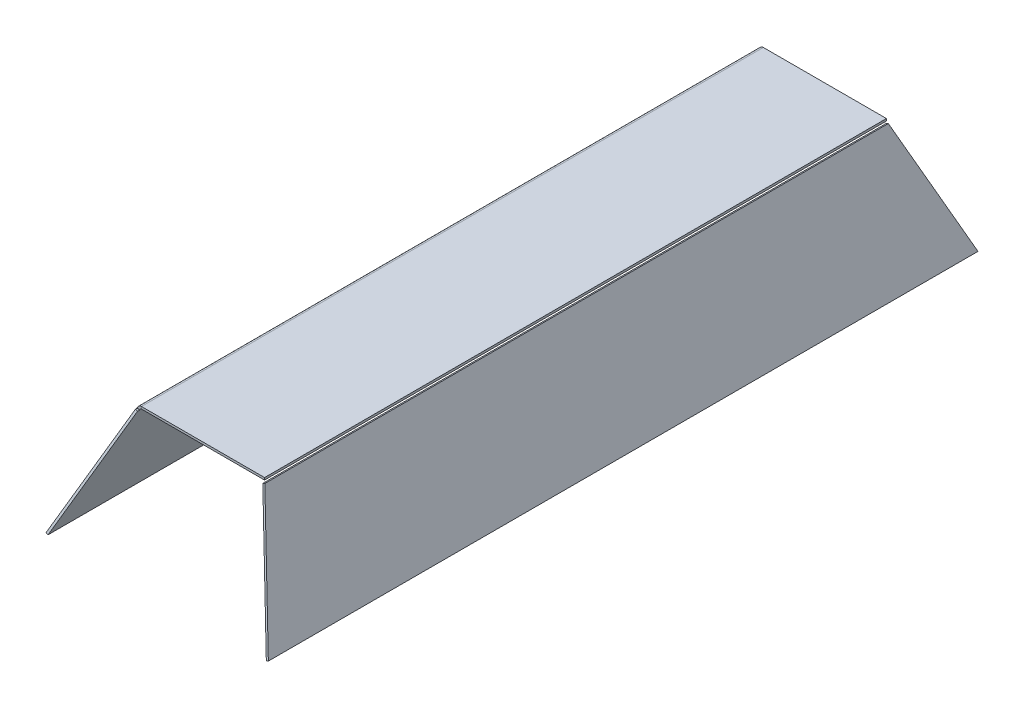
ISO-10303-21;
HEADER;
FILE_DESCRIPTION(('STEP AP214'),'2;1');
FILE_NAME('part.step','',(''),(''),'','','');
FILE_SCHEMA(('AUTOMOTIVE_DESIGN { 1 0 10303 214 1 1 1 1 }'));
ENDSEC;
DATA;
#1=APPLICATION_CONTEXT('core data for automotive mechanical design processes');
#2=APPLICATION_PROTOCOL_DEFINITION('international standard','automotive_design',2000,#1);
#3=PRODUCT_CONTEXT('',#1,'mechanical');
#4=PRODUCT('Part','Part','',(#3));
#5=PRODUCT_RELATED_PRODUCT_CATEGORY('part','',(#4));
#6=PRODUCT_DEFINITION_FORMATION('','',#4);
#7=PRODUCT_DEFINITION_CONTEXT('part definition',#1,'design');
#8=PRODUCT_DEFINITION('design','',#6,#7);
#9=PRODUCT_DEFINITION_SHAPE('','',#8);
#10=(LENGTH_UNIT() NAMED_UNIT(*) SI_UNIT(.MILLI.,.METRE.));
#11=(NAMED_UNIT(*) PLANE_ANGLE_UNIT() SI_UNIT($,.RADIAN.));
#12=(NAMED_UNIT(*) SI_UNIT($,.STERADIAN.) SOLID_ANGLE_UNIT());
#13=UNCERTAINTY_MEASURE_WITH_UNIT(LENGTH_MEASURE(1.E-05),#10,'distance_accuracy_value','');
#14=(GEOMETRIC_REPRESENTATION_CONTEXT(3) GLOBAL_UNCERTAINTY_ASSIGNED_CONTEXT((#13)) GLOBAL_UNIT_ASSIGNED_CONTEXT((#10,
#11,#12)) REPRESENTATION_CONTEXT('',''));
#15=CARTESIAN_POINT('',(0.,0.,0.));
#16=DIRECTION('',(0.,0.,1.));
#17=DIRECTION('',(1.,0.,0.));
#18=AXIS2_PLACEMENT_3D('',#15,#16,#17);
#19=CARTESIAN_POINT('',(84.8429149943111,-2.76186835749196,427.251193685188));
#20=DIRECTION('',(-0.134369652517472,0.314218264348551,0.939793423488437));
#21=DIRECTION('',(0.,-0.948394146945163,0.317093900982273));
#22=AXIS2_PLACEMENT_3D('',#19,#20,#21);
#23=PLANE('',#22);
#24=DIRECTION('',(0.369516544423051,-0.86410022695852,0.341743063086703));
#25=VECTOR('',#24,1.);
#26=CARTESIAN_POINT('',(87.6012878623114,-1.58230101262345,427.251193685188));
#27=LINE('',#26,#25);
#28=CARTESIAN_POINT('',(87.6012878623114,-1.58230101262345,427.251193685188));
#29=VERTEX_POINT('',#28);
#30=CARTESIAN_POINT('',(151.297924485211,-150.534435884636,486.160284594278));
#31=VERTEX_POINT('',#30);
#32=EDGE_CURVE('E122',#29,#31,#27,.T.);
#33=ORIENTED_EDGE('',*,*,#32,.F.);
#34=DIRECTION('',(0.919457622666744,0.393189114956173,0.));
#35=VECTOR('',#34,1.);
#36=CARTESIAN_POINT('',(84.8429149943111,-2.76186835749196,427.251193685188));
#37=LINE('',#36,#35);
#38=CARTESIAN_POINT('',(84.8429149943111,-2.76186835749196,427.251193685188));
#39=VERTEX_POINT('',#38);
#40=EDGE_CURVE('E12',#39,#29,#37,.T.);
#41=ORIENTED_EDGE('',*,*,#40,.F.);
#42=DIRECTION('',(0.369516544423051,-0.86410022695852,0.341743063086703));
#43=VECTOR('',#42,1.);
#44=CARTESIAN_POINT('',(84.8429149943111,-2.76186835749196,427.251193685188));
#45=LINE('',#44,#43);
#46=CARTESIAN_POINT('',(148.539551617211,-151.714003229505,486.160284594278));
#47=VERTEX_POINT('',#46);
#48=EDGE_CURVE('E116',#39,#47,#45,.T.);
#49=ORIENTED_EDGE('',*,*,#48,.T.);
#50=DIRECTION('',(0.919457622666744,0.393189114956173,0.));
#51=VECTOR('',#50,1.);
#52=CARTESIAN_POINT('',(148.539551617211,-151.714003229505,486.160284594278));
#53=LINE('',#52,#51);
#54=EDGE_CURVE('E61',#47,#31,#53,.T.);
#55=ORIENTED_EDGE('',*,*,#54,.T.);
#56=EDGE_LOOP('',(#33,#41,#49,#55));
#57=FACE_BOUND('',#56,.T.);
#58=ADVANCED_FACE('F58',(#57),#23,.T.);
#59=CARTESIAN_POINT('',(84.8429149943111,-2.76186835749195,-424.930624496631));
#60=DIRECTION('',(-0.393189114956173,0.919457622666744,0.));
#61=DIRECTION('',(-0.919457622666744,-0.393189114956173,0.));
#62=AXIS2_PLACEMENT_3D('',#59,#60,#61);
#63=PLANE('',#62);
#64=DIRECTION('',(0.,0.,1.));
#65=VECTOR('',#64,1.);
#66=CARTESIAN_POINT('',(87.6012878623113,-1.58230101262343,-424.930624496631));
#67=LINE('',#66,#65);
#68=CARTESIAN_POINT('',(87.6012878623113,-1.58230101262343,-424.930624496631));
#69=VERTEX_POINT('',#68);
#70=EDGE_CURVE('E118',#69,#29,#67,.T.);
#71=ORIENTED_EDGE('',*,*,#70,.F.);
#72=DIRECTION('',(0.919457622666744,0.393189114956173,0.));
#73=VECTOR('',#72,1.);
#74=CARTESIAN_POINT('',(84.8429149943111,-2.76186835749195,-424.930624496631));
#75=LINE('',#74,#73);
#76=CARTESIAN_POINT('',(84.8429149943111,-2.76186835749195,-424.930624496631));
#77=VERTEX_POINT('',#76);
#78=EDGE_CURVE('E67',#77,#69,#75,.T.);
#79=ORIENTED_EDGE('',*,*,#78,.F.);
#80=DIRECTION('',(0.,0.,1.));
#81=VECTOR('',#80,1.);
#82=CARTESIAN_POINT('',(84.8429149943111,-2.76186835749195,-424.930624496631));
#83=LINE('',#82,#81);
#84=EDGE_CURVE('E113',#77,#39,#83,.T.);
#85=ORIENTED_EDGE('',*,*,#84,.T.);
#86=ORIENTED_EDGE('',*,*,#40,.T.);
#87=EDGE_LOOP('',(#71,#79,#85,#86));
#88=FACE_BOUND('',#87,.T.);
#89=ADVANCED_FACE('F132',(#88),#63,.T.);
#90=CARTESIAN_POINT('',(148.539551617211,-151.714003229505,-483.839715405722));
#91=DIRECTION('',(-0.134369652517473,0.314218264348552,-0.939793423488437));
#92=DIRECTION('',(0.,0.948394146945163,0.317093900982274));
#93=AXIS2_PLACEMENT_3D('',#90,#91,#92);
#94=PLANE('',#93);
#95=DIRECTION('',(-0.369516544423051,0.864100226958519,0.341743063086704));
#96=VECTOR('',#95,1.);
#97=CARTESIAN_POINT('',(151.297924485211,-150.534435884636,-483.839715405722));
#98=LINE('',#97,#96);
#99=CARTESIAN_POINT('',(151.297924485211,-150.534435884636,-483.839715405722));
#100=VERTEX_POINT('',#99);
#101=EDGE_CURVE('E108',#100,#69,#98,.T.);
#102=ORIENTED_EDGE('',*,*,#101,.F.);
#103=DIRECTION('',(0.919457622666744,0.393189114956173,0.));
#104=VECTOR('',#103,1.);
#105=CARTESIAN_POINT('',(148.539551617211,-151.714003229505,-483.839715405722));
#106=LINE('',#105,#104);
#107=CARTESIAN_POINT('',(148.539551617211,-151.714003229505,-483.839715405722));
#108=VERTEX_POINT('',#107);
#109=EDGE_CURVE('E103',#108,#100,#106,.T.);
#110=ORIENTED_EDGE('',*,*,#109,.F.);
#111=DIRECTION('',(-0.369516544423051,0.864100226958519,0.341743063086704));
#112=VECTOR('',#111,1.);
#113=CARTESIAN_POINT('',(148.539551617211,-151.714003229505,-483.839715405722));
#114=LINE('',#113,#112);
#115=EDGE_CURVE('E106',#108,#77,#114,.T.);
#116=ORIENTED_EDGE('',*,*,#115,.T.);
#117=ORIENTED_EDGE('',*,*,#78,.T.);
#118=EDGE_LOOP('',(#102,#110,#116,#117));
#119=FACE_BOUND('',#118,.T.);
#120=ADVANCED_FACE('F105',(#119),#94,.T.);
#121=CARTESIAN_POINT('',(148.539551617211,-151.714003229505,486.160284594278));
#122=DIRECTION('',(0.393189114956173,-0.919457622666744,0.));
#123=DIRECTION('',(0.919457622666744,0.393189114956173,0.));
#124=AXIS2_PLACEMENT_3D('',#121,#122,#123);
#125=PLANE('',#124);
#126=DIRECTION('',(0.,0.,-1.));
#127=VECTOR('',#126,1.);
#128=CARTESIAN_POINT('',(151.297924485211,-150.534435884636,486.160284594278));
#129=LINE('',#128,#127);
#130=EDGE_CURVE('E125',#31,#100,#129,.T.);
#131=ORIENTED_EDGE('',*,*,#130,.F.);
#132=ORIENTED_EDGE('',*,*,#54,.F.);
#133=DIRECTION('',(0.,0.,-1.));
#134=VECTOR('',#133,1.);
#135=CARTESIAN_POINT('',(148.539551617211,-151.714003229505,486.160284594278));
#136=LINE('',#135,#134);
#137=EDGE_CURVE('E112',#47,#108,#136,.T.);
#138=ORIENTED_EDGE('',*,*,#137,.T.);
#139=ORIENTED_EDGE('',*,*,#109,.T.);
#140=EDGE_LOOP('',(#131,#132,#138,#139));
#141=FACE_BOUND('',#140,.T.);
#142=ADVANCED_FACE('F115',(#141),#125,.T.);
#143=CARTESIAN_POINT('',(70.7279244998553,30.2454940295433,0.));
#144=DIRECTION('',(0.919457622666744,0.393189114956173,0.));
#145=DIRECTION('',(-0.393189114956173,0.919457622666745,0.));
#146=AXIS2_PLACEMENT_3D('',#143,#144,#145);
#147=PLANE('',#146);
#148=ORIENTED_EDGE('',*,*,#48,.F.);
#149=ORIENTED_EDGE('',*,*,#84,.F.);
#150=ORIENTED_EDGE('',*,*,#115,.F.);
#151=ORIENTED_EDGE('',*,*,#137,.F.);
#152=EDGE_LOOP('',(#148,#149,#150,#151));
#153=FACE_BOUND('',#152,.T.);
#154=ADVANCED_FACE('F111',(#153),#147,.F.);
#155=CARTESIAN_POINT('',(73.4862973678555,31.4250613744118,0.));
#156=DIRECTION('',(0.919457622666744,0.393189114956173,0.));
#157=DIRECTION('',(-0.393189114956173,0.919457622666745,0.));
#158=AXIS2_PLACEMENT_3D('',#155,#156,#157);
#159=PLANE('',#158);
#160=ORIENTED_EDGE('',*,*,#32,.T.);
#161=ORIENTED_EDGE('',*,*,#130,.T.);
#162=ORIENTED_EDGE('',*,*,#101,.T.);
#163=ORIENTED_EDGE('',*,*,#70,.T.);
#164=EDGE_LOOP('',(#160,#161,#162,#163));
#165=FACE_BOUND('',#164,.T.);
#166=ADVANCED_FACE('F131',(#165),#159,.T.);
#167=CLOSED_SHELL('',(#58,#89,#120,#142,#154,#166));
#168=MANIFOLD_SOLID_BREP('B2',#167);
#169=CARTESIAN_POINT('',(-74.4010070551372,31.8162201222626,0.));
#170=DIRECTION('',(0.919457622666744,-0.393189114956173,0.));
#171=DIRECTION('',(0.393189114956173,0.919457622666744,0.));
#172=AXIS2_PLACEMENT_3D('',#169,#170,#171);
#173=PLANE('',#172);
#174=DIRECTION('',(0.,0.,1.));
#175=VECTOR('',#174,1.);
#176=CARTESIAN_POINT('',(-152.379906005456,-150.534435884636,-483.839715405722));
#177=LINE('',#176,#175);
#178=CARTESIAN_POINT('',(-152.379906005456,-150.534435884636,-483.839715405722));
#179=VERTEX_POINT('',#178);
#180=CARTESIAN_POINT('',(-152.379906005456,-150.534435884636,486.160284594278));
#181=VERTEX_POINT('',#180);
#182=EDGE_CURVE('E200',#179,#181,#177,.T.);
#183=ORIENTED_EDGE('',*,*,#182,.T.);
#184=DIRECTION('',(0.369516544423051,0.86410022695852,-0.341743063086704));
#185=VECTOR('',#184,1.);
#186=CARTESIAN_POINT('',(-88.2900802675994,-0.662843389956598,426.887557321551));
#187=LINE('',#186,#185);
#188=CARTESIAN_POINT('',(-88.2900802675994,-0.662843389956598,426.887557321551));
#189=VERTEX_POINT('',#188);
#190=EDGE_CURVE('E211',#181,#189,#187,.T.);
#191=ORIENTED_EDGE('',*,*,#190,.T.);
#192=DIRECTION('',(0.,0.,-1.));
#193=VECTOR('',#192,1.);
#194=CARTESIAN_POINT('',(-88.2900802675993,-0.662843389956709,-424.566988132994));
#195=LINE('',#194,#193);
#196=CARTESIAN_POINT('',(-88.2900802675993,-0.662843389956709,-424.566988132994));
#197=VERTEX_POINT('',#196);
#198=EDGE_CURVE('E196',#189,#197,#195,.T.);
#199=ORIENTED_EDGE('',*,*,#198,.T.);
#200=DIRECTION('',(-0.369516544423051,-0.86410022695852,-0.341743063086704));
#201=VECTOR('',#200,1.);
#202=CARTESIAN_POINT('',(-88.2900802675993,-0.662843389956709,-424.566988132994));
#203=LINE('',#202,#201);
#204=EDGE_CURVE('E56',#197,#179,#203,.T.);
#205=ORIENTED_EDGE('',*,*,#204,.T.);
#206=EDGE_LOOP('',(#183,#191,#199,#205));
#207=FACE_BOUND('',#206,.T.);
#208=ADVANCED_FACE('F191',(#207),#173,.F.);
#209=OPEN_SHELL('',(#208));
#210=SHELL_BASED_SURFACE_MODEL('B6',(#209));
#211=CARTESIAN_POINT('',(-152.596469008117,-150.441826705866,-425.));
#212=DIRECTION('',(0.,0.,1.));
#213=DIRECTION('',(1.,0.,0.));
#214=AXIS2_PLACEMENT_3D('',#211,#212,#213);
#215=PLANE('',#214);
#216=DIRECTION('',(0.919457622666744,-0.393189114956173,0.));
#217=VECTOR('',#216,1.);
#218=CARTESIAN_POINT('',(-89.0228344323582,-1.77732739024555,-425.));
#219=LINE('',#218,#217);
#220=CARTESIAN_POINT('',(-89.0228344323582,-1.77732739024555,-425.));
#221=VERTEX_POINT('',#220);
#222=CARTESIAN_POINT('',(-86.264461564358,-2.95689473511407,-425.));
#223=VERTEX_POINT('',#222);
#224=EDGE_CURVE('E336',#221,#223,#219,.T.);
#225=ORIENTED_EDGE('',*,*,#224,.F.);
#226=DIRECTION('',(-0.393189114956173,-0.919457622666744,0.));
#227=VECTOR('',#226,1.);
#228=CARTESIAN_POINT('',(-152.596469008117,-150.441826705866,-425.));
#229=LINE('',#228,#227);
#230=CARTESIAN_POINT('',(-88.433050759924,-0.39814095624541,-425.));
#231=VERTEX_POINT('',#230);
#232=EDGE_CURVE('E343',#231,#221,#229,.T.);
#233=ORIENTED_EDGE('',*,*,#232,.F.);
#234=DIRECTION('',(-0.919457622666744,0.393189114956173,0.));
#235=VECTOR('',#234,1.);
#236=CARTESIAN_POINT('',(-85.6746778919237,-1.57770830111394,-425.));
#237=LINE('',#236,#235);
#238=CARTESIAN_POINT('',(-85.6746778919237,-1.57770830111394,-425.));
#239=VERTEX_POINT('',#238);
#240=EDGE_CURVE('E374',#239,#231,#237,.T.);
#241=ORIENTED_EDGE('',*,*,#240,.F.);
#242=DIRECTION('',(-0.393189114956173,-0.919457622666744,0.));
#243=VECTOR('',#242,1.);
#244=CARTESIAN_POINT('',(-149.838096140117,-151.621394050735,-425.));
#245=LINE('',#244,#243);
#246=EDGE_CURVE('E381',#239,#223,#245,.T.);
#247=ORIENTED_EDGE('',*,*,#246,.T.);
#248=EDGE_LOOP('',(#225,#233,#241,#247));
#249=FACE_BOUND('',#248,.T.);
#250=ADVANCED_FACE('F235',(#249),#215,.F.);
#251=CARTESIAN_POINT('',(-87.7583728680002,1.17956734486852,425.));
#252=DIRECTION('',(0.,0.,-1.));
#253=DIRECTION('',(-1.,0.,0.));
#254=AXIS2_PLACEMENT_3D('',#251,#252,#253);
#255=PLANE('',#254);
#256=DIRECTION('',(0.919457622666744,-0.393189114956173,0.));
#257=VECTOR('',#256,1.);
#258=CARTESIAN_POINT('',(-89.0228344323582,-1.77732739024555,425.));
#259=LINE('',#258,#257);
#260=CARTESIAN_POINT('',(-89.0228344323582,-1.77732739024555,425.));
#261=VERTEX_POINT('',#260);
#262=CARTESIAN_POINT('',(-86.264461564358,-2.95689473511402,425.));
#263=VERTEX_POINT('',#262);
#264=EDGE_CURVE('E257',#261,#263,#259,.T.);
#265=ORIENTED_EDGE('',*,*,#264,.T.);
#266=DIRECTION('',(0.393189114956173,0.919457622666744,0.));
#267=VECTOR('',#266,1.);
#268=CARTESIAN_POINT('',(-85.,0.,425.));
#269=LINE('',#268,#267);
#270=CARTESIAN_POINT('',(-85.6746778919237,-1.57770830111394,425.));
#271=VERTEX_POINT('',#270);
#272=EDGE_CURVE('E384',#263,#271,#269,.T.);
#273=ORIENTED_EDGE('',*,*,#272,.T.);
#274=DIRECTION('',(-0.919457622666744,0.393189114956173,0.));
#275=VECTOR('',#274,1.);
#276=CARTESIAN_POINT('',(-85.6746778919237,-1.57770830111395,425.));
#277=LINE('',#276,#275);
#278=CARTESIAN_POINT('',(-88.433050759924,-0.398140956245418,425.));
#279=VERTEX_POINT('',#278);
#280=EDGE_CURVE('E371',#271,#279,#277,.T.);
#281=ORIENTED_EDGE('',*,*,#280,.T.);
#282=DIRECTION('',(0.393189114956173,0.919457622666744,0.));
#283=VECTOR('',#282,1.);
#284=CARTESIAN_POINT('',(-87.7583728680002,1.17956734486852,425.));
#285=LINE('',#284,#283);
#286=EDGE_CURVE('E252',#261,#279,#285,.T.);
#287=ORIENTED_EDGE('',*,*,#286,.F.);
#288=EDGE_LOOP('',(#265,#273,#281,#287));
#289=FACE_BOUND('',#288,.T.);
#290=ADVANCED_FACE('F472',(#289),#255,.F.);
#291=CARTESIAN_POINT('',(0.,0.,1.70234197109191E-13));
#292=DIRECTION('',(0.,1.,0.));
#293=DIRECTION('',(0.,0.,1.));
#294=AXIS2_PLACEMENT_3D('',#291,#292,#293);
#295=PLANE('',#294);
#296=DIRECTION('',(0.,0.,-1.));
#297=VECTOR('',#296,1.);
#298=CARTESIAN_POINT('',(-83.2840880729902,0.,-425.));
#299=LINE('',#298,#297);
#300=CARTESIAN_POINT('',(-83.2840880729902,0.,-425.));
#301=VERTEX_POINT('',#300);
#302=CARTESIAN_POINT('',(-83.2840880729902,0.,425.));
#303=VERTEX_POINT('',#302);
#304=EDGE_CURVE('E406',#301,#303,#299,.F.);
#305=ORIENTED_EDGE('',*,*,#304,.F.);
#306=DIRECTION('',(-1.,0.,0.));
#307=VECTOR('',#306,1.);
#308=CARTESIAN_POINT('',(-85.,0.,-425.));
#309=LINE('',#308,#307);
#310=CARTESIAN_POINT('',(85.,0.,-425.));
#311=VERTEX_POINT('',#310);
#312=EDGE_CURVE('E419',#311,#301,#309,.T.);
#313=ORIENTED_EDGE('',*,*,#312,.F.);
#314=DIRECTION('',(0.,0.,-1.));
#315=VECTOR('',#314,1.);
#316=CARTESIAN_POINT('',(85.,0.,-425.));
#317=LINE('',#316,#315);
#318=CARTESIAN_POINT('',(85.0000000000001,0.,425.));
#319=VERTEX_POINT('',#318);
#320=EDGE_CURVE('E425',#319,#311,#317,.T.);
#321=ORIENTED_EDGE('',*,*,#320,.F.);
#322=DIRECTION('',(1.,0.,0.));
#323=VECTOR('',#322,1.);
#324=CARTESIAN_POINT('',(85.0000000000001,0.,425.));
#325=LINE('',#324,#323);
#326=EDGE_CURVE('E239',#303,#319,#325,.T.);
#327=ORIENTED_EDGE('',*,*,#326,.F.);
#328=EDGE_LOOP('',(#305,#313,#321,#327));
#329=FACE_BOUND('',#328,.T.);
#330=ADVANCED_FACE('F237',(#329),#295,.F.);
#331=CARTESIAN_POINT('',(-85.,0.,-425.));
#332=DIRECTION('',(0.,0.,-1.));
#333=DIRECTION('',(-1.,0.,0.));
#334=AXIS2_PLACEMENT_3D('',#331,#332,#333);
#335=PLANE('',#334);
#336=ORIENTED_EDGE('',*,*,#312,.T.);
#337=DIRECTION('',(0.,1.,0.));
#338=VECTOR('',#337,1.);
#339=CARTESIAN_POINT('',(-83.2840880729902,0.,-425.));
#340=LINE('',#339,#338);
#341=CARTESIAN_POINT('',(-83.2840880729901,3.00000000000002,-425.));
#342=VERTEX_POINT('',#341);
#343=EDGE_CURVE('E400',#301,#342,#340,.T.);
#344=ORIENTED_EDGE('',*,*,#343,.T.);
#345=DIRECTION('',(1.,0.,0.));
#346=VECTOR('',#345,1.);
#347=CARTESIAN_POINT('',(0.,3.,-425.));
#348=LINE('',#347,#346);
#349=CARTESIAN_POINT('',(85.,3.,-425.));
#350=VERTEX_POINT('',#349);
#351=EDGE_CURVE('E189',#350,#342,#348,.F.);
#352=ORIENTED_EDGE('',*,*,#351,.F.);
#353=DIRECTION('',(0.,1.,0.));
#354=VECTOR('',#353,1.);
#355=CARTESIAN_POINT('',(85.,0.,-425.));
#356=LINE('',#355,#354);
#357=EDGE_CURVE('E422',#350,#311,#356,.F.);
#358=ORIENTED_EDGE('',*,*,#357,.T.);
#359=EDGE_LOOP('',(#336,#344,#352,#358));
#360=FACE_BOUND('',#359,.T.);
#361=ADVANCED_FACE('F443',(#360),#335,.T.);
#362=CARTESIAN_POINT('',(0.,3.,1.70234197109191E-13));
#363=DIRECTION('',(0.,1.,0.));
#364=DIRECTION('',(0.,0.,1.));
#365=AXIS2_PLACEMENT_3D('',#362,#363,#364);
#366=PLANE('',#365);
#367=ORIENTED_EDGE('',*,*,#351,.T.);
#368=DIRECTION('',(0.,0.,-1.));
#369=VECTOR('',#368,1.);
#370=CARTESIAN_POINT('',(-83.2840880729901,3.00000000000002,-425.));
#371=LINE('',#370,#369);
#372=CARTESIAN_POINT('',(-83.2840880729902,3.,425.));
#373=VERTEX_POINT('',#372);
#374=EDGE_CURVE('E393',#342,#373,#371,.F.);
#375=ORIENTED_EDGE('',*,*,#374,.T.);
#376=DIRECTION('',(1.,0.,0.));
#377=VECTOR('',#376,1.);
#378=CARTESIAN_POINT('',(0.,3.,425.));
#379=LINE('',#378,#377);
#380=CARTESIAN_POINT('',(85.0000000000001,3.,425.));
#381=VERTEX_POINT('',#380);
#382=EDGE_CURVE('E417',#373,#381,#379,.T.);
#383=ORIENTED_EDGE('',*,*,#382,.T.);
#384=DIRECTION('',(0.,0.,1.));
#385=VECTOR('',#384,1.);
#386=CARTESIAN_POINT('',(85.0000000000001,3.,1.70234197109191E-13));
#387=LINE('',#386,#385);
#388=EDGE_CURVE('E244',#381,#350,#387,.F.);
#389=ORIENTED_EDGE('',*,*,#388,.T.);
#390=EDGE_LOOP('',(#367,#375,#383,#389));
#391=FACE_BOUND('',#390,.T.);
#392=ADVANCED_FACE('F445',(#391),#366,.T.);
#393=CARTESIAN_POINT('',(85.0000000000001,0.,425.));
#394=DIRECTION('',(0.,0.,1.));
#395=DIRECTION('',(1.,0.,0.));
#396=AXIS2_PLACEMENT_3D('',#393,#394,#395);
#397=PLANE('',#396);
#398=DIRECTION('',(0.,1.,0.));
#399=VECTOR('',#398,1.);
#400=CARTESIAN_POINT('',(-83.2840880729902,0.,425.));
#401=LINE('',#400,#399);
#402=EDGE_CURVE('E410',#303,#373,#401,.T.);
#403=ORIENTED_EDGE('',*,*,#402,.F.);
#404=ORIENTED_EDGE('',*,*,#326,.T.);
#405=DIRECTION('',(0.,1.,0.));
#406=VECTOR('',#405,1.);
#407=CARTESIAN_POINT('',(85.0000000000002,0.,425.));
#408=LINE('',#407,#406);
#409=EDGE_CURVE('E426',#381,#319,#408,.F.);
#410=ORIENTED_EDGE('',*,*,#409,.F.);
#411=ORIENTED_EDGE('',*,*,#382,.F.);
#412=EDGE_LOOP('',(#403,#404,#410,#411));
#413=FACE_BOUND('',#412,.T.);
#414=ADVANCED_FACE('F435',(#413),#397,.T.);
#415=CARTESIAN_POINT('',(85.,0.,-425.));
#416=DIRECTION('',(1.,0.,0.));
#417=DIRECTION('',(0.,0.,-1.));
#418=AXIS2_PLACEMENT_3D('',#415,#416,#417);
#419=PLANE('',#418);
#420=ORIENTED_EDGE('',*,*,#320,.T.);
#421=ORIENTED_EDGE('',*,*,#357,.F.);
#422=ORIENTED_EDGE('',*,*,#388,.F.);
#423=ORIENTED_EDGE('',*,*,#409,.T.);
#424=EDGE_LOOP('',(#420,#421,#422,#423));
#425=FACE_BOUND('',#424,.T.);
#426=ADVANCED_FACE('F440',(#425),#419,.T.);
#427=CARTESIAN_POINT('',(-83.2840880729902,-2.59999999999999,425.));
#428=DIRECTION('',(0.,0.,1.));
#429=DIRECTION('',(1.,0.,0.));
#430=AXIS2_PLACEMENT_3D('',#427,#428,#429);
#431=PLANE('',#430);
#432=ORIENTED_EDGE('',*,*,#280,.F.);
#433=CARTESIAN_POINT('',(-83.2840880729902,-2.59999999999999,425.));
#434=DIRECTION('',(0.,0.,-1.));
#435=DIRECTION('',(-1.,0.,0.));
#436=AXIS2_PLACEMENT_3D('',#433,#434,#435);
#437=CIRCLE('',#436,2.60000000000001);
#438=EDGE_CURVE('E403',#303,#271,#437,.F.);
#439=ORIENTED_EDGE('',*,*,#438,.F.);
#440=ORIENTED_EDGE('',*,*,#402,.T.);
#441=CARTESIAN_POINT('',(-83.2840880729902,-2.59999999999999,425.));
#442=DIRECTION('',(0.,0.,-1.));
#443=DIRECTION('',(-1.,0.,0.));
#444=AXIS2_PLACEMENT_3D('',#441,#442,#443);
#445=CIRCLE('',#444,5.60000000000001);
#446=EDGE_CURVE('E396',#373,#279,#445,.F.);
#447=ORIENTED_EDGE('',*,*,#446,.T.);
#448=EDGE_LOOP('',(#432,#439,#440,#447));
#449=FACE_BOUND('',#448,.T.);
#450=ADVANCED_FACE('F475',(#449),#431,.T.);
#451=CARTESIAN_POINT('',(-83.2840880729902,-2.59999999999999,-425.));
#452=DIRECTION('',(0.,0.,1.));
#453=DIRECTION('',(1.,0.,0.));
#454=AXIS2_PLACEMENT_3D('',#451,#452,#453);
#455=PLANE('',#454);
#456=CARTESIAN_POINT('',(-83.2840880729902,-2.59999999999999,-425.));
#457=DIRECTION('',(0.,0.,-1.));
#458=DIRECTION('',(-1.,0.,0.));
#459=AXIS2_PLACEMENT_3D('',#456,#457,#458);
#460=CIRCLE('',#459,2.60000000000001);
#461=EDGE_CURVE('E387',#239,#301,#460,.T.);
#462=ORIENTED_EDGE('',*,*,#461,.F.);
#463=ORIENTED_EDGE('',*,*,#240,.T.);
#464=CARTESIAN_POINT('',(-83.2840880729902,-2.59999999999999,-425.));
#465=DIRECTION('',(0.,0.,-1.));
#466=DIRECTION('',(-1.,0.,0.));
#467=AXIS2_PLACEMENT_3D('',#464,#465,#466);
#468=CIRCLE('',#467,5.60000000000001);
#469=EDGE_CURVE('E397',#231,#342,#468,.T.);
#470=ORIENTED_EDGE('',*,*,#469,.T.);
#471=ORIENTED_EDGE('',*,*,#343,.F.);
#472=EDGE_LOOP('',(#462,#463,#470,#471));
#473=FACE_BOUND('',#472,.T.);
#474=ADVANCED_FACE('F450',(#473),#455,.F.);
#475=CARTESIAN_POINT('',(-83.2840880729902,-2.59999999999999,-425.));
#476=DIRECTION('',(0.,0.,-1.));
#477=DIRECTION('',(-0.919457622666744,0.393189114956173,0.));
#478=AXIS2_PLACEMENT_3D('',#475,#476,#477);
#479=CYLINDRICAL_SURFACE('',#478,5.60000000000001);
#480=ORIENTED_EDGE('',*,*,#374,.F.);
#481=ORIENTED_EDGE('',*,*,#469,.F.);
#482=DIRECTION('',(0.,0.,1.));
#483=VECTOR('',#482,1.);
#484=CARTESIAN_POINT('',(-88.433050759924,-0.398140956245414,0.));
#485=LINE('',#484,#483);
#486=EDGE_CURVE('E377',#231,#279,#485,.T.);
#487=ORIENTED_EDGE('',*,*,#486,.T.);
#488=ORIENTED_EDGE('',*,*,#446,.F.);
#489=EDGE_LOOP('',(#480,#481,#487,#488));
#490=FACE_BOUND('',#489,.T.);
#491=ADVANCED_FACE('F447',(#490),#479,.T.);
#492=CARTESIAN_POINT('',(-83.2840880729902,-2.59999999999999,-425.));
#493=DIRECTION('',(0.,0.,-1.));
#494=DIRECTION('',(-0.919457622666744,0.393189114956173,0.));
#495=AXIS2_PLACEMENT_3D('',#492,#493,#494);
#496=CYLINDRICAL_SURFACE('',#495,2.60000000000001);
#497=ORIENTED_EDGE('',*,*,#304,.T.);
#498=ORIENTED_EDGE('',*,*,#438,.T.);
#499=DIRECTION('',(0.,0.,-1.));
#500=VECTOR('',#499,1.);
#501=CARTESIAN_POINT('',(-85.6746778919237,-1.57770830111395,425.));
#502=LINE('',#501,#500);
#503=EDGE_CURVE('E372',#271,#239,#502,.T.);
#504=ORIENTED_EDGE('',*,*,#503,.T.);
#505=ORIENTED_EDGE('',*,*,#461,.T.);
#506=EDGE_LOOP('',(#497,#498,#504,#505));
#507=FACE_BOUND('',#506,.T.);
#508=ADVANCED_FACE('F477',(#507),#496,.F.);
#509=CARTESIAN_POINT('',(-74.6175700577986,31.9088293010323,0.));
#510=DIRECTION('',(0.919457622666744,-0.393189114956173,0.));
#511=DIRECTION('',(0.393189114956173,0.919457622666744,0.));
#512=AXIS2_PLACEMENT_3D('',#509,#510,#511);
#513=PLANE('',#512);
#514=ORIENTED_EDGE('',*,*,#486,.F.);
#515=ORIENTED_EDGE('',*,*,#232,.T.);
#516=DIRECTION('',(0.,1.56346523683228E-13,-1.));
#517=VECTOR('',#516,1.);
#518=CARTESIAN_POINT('',(-89.0228344323582,-1.77732739024555,-425.));
#519=LINE('',#518,#517);
#520=CARTESIAN_POINT('',(-89.0228344323582,-1.77732739024554,-425.044381504241));
#521=VERTEX_POINT('',#520);
#522=EDGE_CURVE('E337',#221,#521,#519,.T.);
#523=ORIENTED_EDGE('',*,*,#522,.T.);
#524=DIRECTION('',(-0.369516544423051,-0.864100226958519,-0.341743063086704));
#525=VECTOR('',#524,1.);
#526=CARTESIAN_POINT('',(-89.0228344323582,-1.77732739024554,-425.044381504241));
#527=LINE('',#526,#525);
#528=CARTESIAN_POINT('',(-152.596469008117,-150.441826705866,-483.839715405722));
#529=VERTEX_POINT('',#528);
#530=EDGE_CURVE('E326',#521,#529,#527,.T.);
#531=ORIENTED_EDGE('',*,*,#530,.T.);
#532=DIRECTION('',(0.,0.,1.));
#533=VECTOR('',#532,1.);
#534=CARTESIAN_POINT('',(-152.596469008117,-150.441826705866,425.));
#535=LINE('',#534,#533);
#536=CARTESIAN_POINT('',(-152.596469008117,-150.441826705866,486.160284594278));
#537=VERTEX_POINT('',#536);
#538=EDGE_CURVE('E383',#529,#537,#535,.T.);
#539=ORIENTED_EDGE('',*,*,#538,.T.);
#540=DIRECTION('',(0.369516544423051,0.864100226958519,-0.341743063086704));
#541=VECTOR('',#540,1.);
#542=CARTESIAN_POINT('',(-152.596469008117,-150.441826705866,486.160284594278));
#543=LINE('',#542,#541);
#544=CARTESIAN_POINT('',(-89.0228344323582,-1.77732739024554,427.364950692798));
#545=VERTEX_POINT('',#544);
#546=EDGE_CURVE('E361',#537,#545,#543,.T.);
#547=ORIENTED_EDGE('',*,*,#546,.T.);
#548=DIRECTION('',(0.,0.,-1.));
#549=VECTOR('',#548,1.);
#550=CARTESIAN_POINT('',(-89.0228344323582,-1.77732739024554,427.364950692798));
#551=LINE('',#550,#549);
#552=EDGE_CURVE('E359',#545,#261,#551,.T.);
#553=ORIENTED_EDGE('',*,*,#552,.T.);
#554=ORIENTED_EDGE('',*,*,#286,.T.);
#555=EDGE_LOOP('',(#514,#515,#523,#531,#539,#547,#553,#554));
#556=FACE_BOUND('',#555,.T.);
#557=ADVANCED_FACE('F341',(#556),#513,.F.);
#558=CARTESIAN_POINT('',(-71.8591971897984,30.7292619561638,0.));
#559=DIRECTION('',(0.919457622666744,-0.393189114956173,0.));
#560=DIRECTION('',(0.393189114956173,0.919457622666744,0.));
#561=AXIS2_PLACEMENT_3D('',#558,#559,#560);
#562=PLANE('',#561);
#563=ORIENTED_EDGE('',*,*,#246,.F.);
#564=ORIENTED_EDGE('',*,*,#503,.F.);
#565=ORIENTED_EDGE('',*,*,#272,.F.);
#566=DIRECTION('',(0.,0.,-1.));
#567=VECTOR('',#566,1.);
#568=CARTESIAN_POINT('',(-86.264461564358,-2.95689473511406,427.364950692798));
#569=LINE('',#568,#567);
#570=CARTESIAN_POINT('',(-86.264461564358,-2.95689473511406,427.364950692798));
#571=VERTEX_POINT('',#570);
#572=EDGE_CURVE('E351',#571,#263,#569,.T.);
#573=ORIENTED_EDGE('',*,*,#572,.F.);
#574=DIRECTION('',(0.369516544423051,0.864100226958519,-0.341743063086704));
#575=VECTOR('',#574,1.);
#576=CARTESIAN_POINT('',(-149.838096140117,-151.621394050735,486.160284594278));
#577=LINE('',#576,#575);
#578=CARTESIAN_POINT('',(-149.838096140117,-151.621394050735,486.160284594278));
#579=VERTEX_POINT('',#578);
#580=EDGE_CURVE('E354',#579,#571,#577,.T.);
#581=ORIENTED_EDGE('',*,*,#580,.F.);
#582=DIRECTION('',(0.,0.,1.));
#583=VECTOR('',#582,1.);
#584=CARTESIAN_POINT('',(-149.838096140117,-151.621394050735,425.));
#585=LINE('',#584,#583);
#586=CARTESIAN_POINT('',(-149.838096140117,-151.621394050735,-483.839715405722));
#587=VERTEX_POINT('',#586);
#588=EDGE_CURVE('E390',#587,#579,#585,.T.);
#589=ORIENTED_EDGE('',*,*,#588,.F.);
#590=DIRECTION('',(-0.369516544423051,-0.864100226958519,-0.341743063086704));
#591=VECTOR('',#590,1.);
#592=CARTESIAN_POINT('',(-86.264461564358,-2.95689473511406,-425.044381504241));
#593=LINE('',#592,#591);
#594=CARTESIAN_POINT('',(-86.264461564358,-2.95689473511406,-425.044381504241));
#595=VERTEX_POINT('',#594);
#596=EDGE_CURVE('E346',#595,#587,#593,.T.);
#597=ORIENTED_EDGE('',*,*,#596,.F.);
#598=DIRECTION('',(0.,1.56346523683228E-13,-1.));
#599=VECTOR('',#598,1.);
#600=CARTESIAN_POINT('',(-86.264461564358,-2.95689473511407,-425.));
#601=LINE('',#600,#599);
#602=EDGE_CURVE('E350',#223,#595,#601,.T.);
#603=ORIENTED_EDGE('',*,*,#602,.F.);
#604=EDGE_LOOP('',(#563,#564,#565,#573,#581,#589,#597,#603));
#605=FACE_BOUND('',#604,.T.);
#606=ADVANCED_FACE('F469',(#605),#562,.T.);
#607=CARTESIAN_POINT('',(-152.596469008117,-150.441826705866,425.));
#608=DIRECTION('',(0.393189114956173,0.919457622666744,0.));
#609=DIRECTION('',(-0.919457622666744,0.393189114956173,0.));
#610=AXIS2_PLACEMENT_3D('',#607,#608,#609);
#611=PLANE('',#610);
#612=ORIENTED_EDGE('',*,*,#588,.T.);
#613=DIRECTION('',(0.919457622666744,-0.393189114956173,0.));
#614=VECTOR('',#613,1.);
#615=CARTESIAN_POINT('',(-152.596469008117,-150.441826705866,486.160284594278));
#616=LINE('',#615,#614);
#617=EDGE_CURVE('E367',#537,#579,#616,.T.);
#618=ORIENTED_EDGE('',*,*,#617,.F.);
#619=ORIENTED_EDGE('',*,*,#538,.F.);
#620=DIRECTION('',(0.919457622666744,-0.393189114956173,0.));
#621=VECTOR('',#620,1.);
#622=CARTESIAN_POINT('',(-152.596469008117,-150.441826705866,-483.839715405722));
#623=LINE('',#622,#621);
#624=EDGE_CURVE('E334',#529,#587,#623,.T.);
#625=ORIENTED_EDGE('',*,*,#624,.T.);
#626=EDGE_LOOP('',(#612,#618,#619,#625));
#627=FACE_BOUND('',#626,.T.);
#628=ADVANCED_FACE('F458',(#627),#611,.F.);
#629=CARTESIAN_POINT('',(-89.0228344323582,-1.77732739024554,427.364950692798));
#630=DIRECTION('',(-0.393189114956173,-0.919457622666744,0.));
#631=DIRECTION('',(0.919457622666744,-0.393189114956173,0.));
#632=AXIS2_PLACEMENT_3D('',#629,#630,#631);
#633=PLANE('',#632);
#634=ORIENTED_EDGE('',*,*,#572,.T.);
#635=ORIENTED_EDGE('',*,*,#264,.F.);
#636=ORIENTED_EDGE('',*,*,#552,.F.);
#637=DIRECTION('',(0.919457622666744,-0.393189114956173,0.));
#638=VECTOR('',#637,1.);
#639=CARTESIAN_POINT('',(-89.0228344323582,-1.77732739024554,427.364950692798));
#640=LINE('',#639,#638);
#641=EDGE_CURVE('E362',#545,#571,#640,.T.);
#642=ORIENTED_EDGE('',*,*,#641,.T.);
#643=EDGE_LOOP('',(#634,#635,#636,#642));
#644=FACE_BOUND('',#643,.T.);
#645=ADVANCED_FACE('F468',(#644),#633,.F.);
#646=CARTESIAN_POINT('',(-152.596469008117,-150.441826705866,486.160284594278));
#647=DIRECTION('',(-0.134369652517473,-0.314218264348552,-0.939793423488437));
#648=DIRECTION('',(0.,0.948394146945163,-0.317093900982274));
#649=AXIS2_PLACEMENT_3D('',#646,#647,#648);
#650=PLANE('',#649);
#651=ORIENTED_EDGE('',*,*,#580,.T.);
#652=ORIENTED_EDGE('',*,*,#641,.F.);
#653=ORIENTED_EDGE('',*,*,#546,.F.);
#654=ORIENTED_EDGE('',*,*,#617,.T.);
#655=EDGE_LOOP('',(#651,#652,#653,#654));
#656=FACE_BOUND('',#655,.T.);
#657=ADVANCED_FACE('F464',(#656),#650,.F.);
#658=CARTESIAN_POINT('',(-89.0228344323582,-1.77732739024555,-425.));
#659=DIRECTION('',(-0.393189114956173,-0.919457622666744,-1.4375400297799E-13));
#660=DIRECTION('',(0.919457622666744,-0.393189114956173,0.));
#661=AXIS2_PLACEMENT_3D('',#658,#659,#660);
#662=PLANE('',#661);
#663=ORIENTED_EDGE('',*,*,#602,.T.);
#664=DIRECTION('',(0.919457622666744,-0.393189114956173,0.));
#665=VECTOR('',#664,1.);
#666=CARTESIAN_POINT('',(-89.0228344323582,-1.77732739024554,-425.044381504241));
#667=LINE('',#666,#665);
#668=EDGE_CURVE('E331',#521,#595,#667,.T.);
#669=ORIENTED_EDGE('',*,*,#668,.F.);
#670=ORIENTED_EDGE('',*,*,#522,.F.);
#671=ORIENTED_EDGE('',*,*,#224,.T.);
#672=EDGE_LOOP('',(#663,#669,#670,#671));
#673=FACE_BOUND('',#672,.T.);
#674=ADVANCED_FACE('F348',(#673),#662,.F.);
#675=CARTESIAN_POINT('',(-89.0228344323582,-1.77732739024554,-425.044381504241));
#676=DIRECTION('',(-0.134369652517473,-0.314218264348552,0.939793423488437));
#677=DIRECTION('',(0.,-0.948394146945163,-0.317093900982274));
#678=AXIS2_PLACEMENT_3D('',#675,#676,#677);
#679=PLANE('',#678);
#680=ORIENTED_EDGE('',*,*,#596,.T.);
#681=ORIENTED_EDGE('',*,*,#624,.F.);
#682=ORIENTED_EDGE('',*,*,#530,.F.);
#683=ORIENTED_EDGE('',*,*,#668,.T.);
#684=EDGE_LOOP('',(#680,#681,#682,#683));
#685=FACE_BOUND('',#684,.T.);
#686=ADVANCED_FACE('F329',(#685),#679,.F.);
#687=CLOSED_SHELL('',(#250,#290,#330,#361,#392,#414,#426,#450,#474,#491,#508,#557,#606,#628,
#645,#657,#674,#686));
#688=MANIFOLD_SOLID_BREP('B50',#687);
#689=ADVANCED_BREP_SHAPE_REPRESENTATION('',(#18,#168,#688),#14);
#690=MANIFOLD_SURFACE_SHAPE_REPRESENTATION('',(#18,#210),#14);
#691=SHAPE_REPRESENTATION('',(#18),#14);
#692=SHAPE_DEFINITION_REPRESENTATION(#9,#691);
#693=SHAPE_REPRESENTATION_RELATIONSHIP('','',#691,#689);
#694=SHAPE_REPRESENTATION_RELATIONSHIP('','',#691,#690);
ENDSEC;
END-ISO-10303-21;
